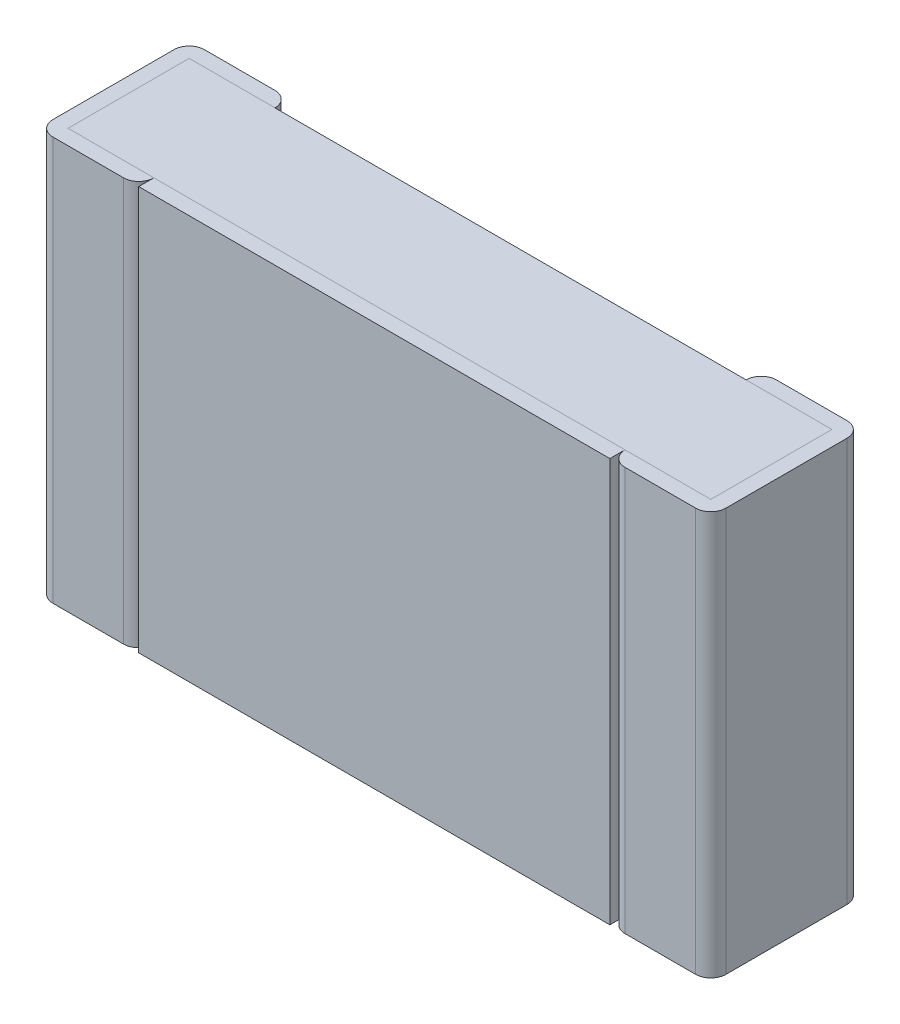
ISO-10303-21;
HEADER;
FILE_DESCRIPTION(('STEP AP214'),'2;1');
FILE_NAME('part.step','',(''),(''),'','','');
FILE_SCHEMA(('AUTOMOTIVE_DESIGN { 1 0 10303 214 1 1 1 1 }'));
ENDSEC;
DATA;
#1=APPLICATION_CONTEXT('core data for automotive mechanical design processes');
#2=APPLICATION_PROTOCOL_DEFINITION('international standard','automotive_design',2000,#1);
#3=PRODUCT_CONTEXT('',#1,'mechanical');
#4=PRODUCT('Part','Part','',(#3));
#5=PRODUCT_RELATED_PRODUCT_CATEGORY('part','',(#4));
#6=PRODUCT_DEFINITION_FORMATION('','',#4);
#7=PRODUCT_DEFINITION_CONTEXT('part definition',#1,'design');
#8=PRODUCT_DEFINITION('design','',#6,#7);
#9=PRODUCT_DEFINITION_SHAPE('','',#8);
#10=(LENGTH_UNIT() NAMED_UNIT(*) SI_UNIT(.MILLI.,.METRE.));
#11=(NAMED_UNIT(*) PLANE_ANGLE_UNIT() SI_UNIT($,.RADIAN.));
#12=(NAMED_UNIT(*) SI_UNIT($,.STERADIAN.) SOLID_ANGLE_UNIT());
#13=UNCERTAINTY_MEASURE_WITH_UNIT(LENGTH_MEASURE(1.E-05),#10,'distance_accuracy_value','');
#14=(GEOMETRIC_REPRESENTATION_CONTEXT(3) GLOBAL_UNCERTAINTY_ASSIGNED_CONTEXT((#13)) GLOBAL_UNIT_ASSIGNED_CONTEXT((#10,
#11,#12)) REPRESENTATION_CONTEXT('',''));
#15=CARTESIAN_POINT('',(0.,0.,0.));
#16=DIRECTION('',(0.,0.,1.));
#17=DIRECTION('',(1.,0.,0.));
#18=AXIS2_PLACEMENT_3D('',#15,#16,#17);
#19=CARTESIAN_POINT('',(-1.,-0.6,0.));
#20=DIRECTION('',(1.,0.,0.));
#21=DIRECTION('',(0.,1.,0.));
#22=AXIS2_PLACEMENT_3D('',#19,#20,#21);
#23=PLANE('',#22);
#24=DIRECTION('',(0.,1.,0.));
#25=VECTOR('',#24,1.);
#26=CARTESIAN_POINT('',(-1.,-0.6,0.405));
#27=LINE('',#26,#25);
#28=CARTESIAN_POINT('',(-1.,-0.6,0.405));
#29=VERTEX_POINT('',#28);
#30=CARTESIAN_POINT('',(-1.,0.6,0.405));
#31=VERTEX_POINT('',#30);
#32=EDGE_CURVE('E11',#29,#31,#27,.T.);
#33=ORIENTED_EDGE('',*,*,#32,.T.);
#34=DIRECTION('',(0.,0.,1.));
#35=VECTOR('',#34,1.);
#36=CARTESIAN_POINT('',(-1.,0.6,0.));
#37=LINE('',#36,#35);
#38=CARTESIAN_POINT('',(-1.,0.6,0.045));
#39=VERTEX_POINT('',#38);
#40=EDGE_CURVE('E41',#39,#31,#37,.T.);
#41=ORIENTED_EDGE('',*,*,#40,.F.);
#42=DIRECTION('',(0.,1.,0.));
#43=VECTOR('',#42,1.);
#44=CARTESIAN_POINT('',(-1.,-0.6,0.045));
#45=LINE('',#44,#43);
#46=CARTESIAN_POINT('',(-1.,-0.6,0.045));
#47=VERTEX_POINT('',#46);
#48=EDGE_CURVE('E222',#47,#39,#45,.T.);
#49=ORIENTED_EDGE('',*,*,#48,.F.);
#50=DIRECTION('',(0.,0.,1.));
#51=VECTOR('',#50,1.);
#52=CARTESIAN_POINT('',(-1.,-0.6,0.));
#53=LINE('',#52,#51);
#54=EDGE_CURVE('E27',#47,#29,#53,.T.);
#55=ORIENTED_EDGE('',*,*,#54,.T.);
#56=EDGE_LOOP('',(#33,#41,#49,#55));
#57=FACE_BOUND('',#56,.T.);
#58=ADVANCED_FACE('F16',(#57),#23,.F.);
#59=CARTESIAN_POINT('',(-1.,-0.6,0.));
#60=DIRECTION('',(0.,1.,0.));
#61=DIRECTION('',(1.,0.,0.));
#62=AXIS2_PLACEMENT_3D('',#59,#60,#61);
#63=PLANE('',#62);
#64=CARTESIAN_POINT('',(-0.745,-0.6,0.045));
#65=DIRECTION('',(0.,1.,0.));
#66=DIRECTION('',(0.,0.,1.));
#67=AXIS2_PLACEMENT_3D('',#64,#65,#66);
#68=CIRCLE('',#67,0.045);
#69=CARTESIAN_POINT('',(-0.7,-0.6,0.045));
#70=VERTEX_POINT('',#69);
#71=CARTESIAN_POINT('',(-0.745,-0.6,0.));
#72=VERTEX_POINT('',#71);
#73=EDGE_CURVE('E248',#70,#72,#68,.T.);
#74=ORIENTED_EDGE('',*,*,#73,.F.);
#75=DIRECTION('',(1.,0.,0.));
#76=VECTOR('',#75,1.);
#77=CARTESIAN_POINT('',(-0.955,-0.6,0.045));
#78=LINE('',#77,#76);
#79=CARTESIAN_POINT('',(-0.955,-0.6,0.045));
#80=VERTEX_POINT('',#79);
#81=EDGE_CURVE('E274',#80,#70,#78,.T.);
#82=ORIENTED_EDGE('',*,*,#81,.F.);
#83=DIRECTION('',(0.,0.,1.));
#84=VECTOR('',#83,1.);
#85=CARTESIAN_POINT('',(-0.955,-0.6,0.045));
#86=LINE('',#85,#84);
#87=CARTESIAN_POINT('',(-0.955,-0.6,0.405));
#88=VERTEX_POINT('',#87);
#89=EDGE_CURVE('E257',#80,#88,#86,.T.);
#90=ORIENTED_EDGE('',*,*,#89,.T.);
#91=DIRECTION('',(1.,0.,0.));
#92=VECTOR('',#91,1.);
#93=CARTESIAN_POINT('',(-0.955,-0.6,0.405));
#94=LINE('',#93,#92);
#95=CARTESIAN_POINT('',(-0.7,-0.6,0.405));
#96=VERTEX_POINT('',#95);
#97=EDGE_CURVE('E356',#88,#96,#94,.T.);
#98=ORIENTED_EDGE('',*,*,#97,.T.);
#99=CARTESIAN_POINT('',(-0.745,-0.6,0.405));
#100=DIRECTION('',(0.,-1.,0.));
#101=DIRECTION('',(0.,0.,1.));
#102=AXIS2_PLACEMENT_3D('',#99,#100,#101);
#103=CIRCLE('',#102,0.045);
#104=CARTESIAN_POINT('',(-0.745,-0.6,0.45));
#105=VERTEX_POINT('',#104);
#106=EDGE_CURVE('E231',#96,#105,#103,.T.);
#107=ORIENTED_EDGE('',*,*,#106,.T.);
#108=DIRECTION('',(1.,0.,0.));
#109=VECTOR('',#108,1.);
#110=CARTESIAN_POINT('',(-1.,-0.6,0.45));
#111=LINE('',#110,#109);
#112=CARTESIAN_POINT('',(-0.955,-0.6,0.45));
#113=VERTEX_POINT('',#112);
#114=EDGE_CURVE('E381',#113,#105,#111,.T.);
#115=ORIENTED_EDGE('',*,*,#114,.F.);
#116=CARTESIAN_POINT('',(-0.955,-0.6,0.405));
#117=DIRECTION('',(0.,1.,0.));
#118=DIRECTION('',(0.,0.,1.));
#119=AXIS2_PLACEMENT_3D('',#116,#117,#118);
#120=CIRCLE('',#119,0.045);
#121=EDGE_CURVE('E406',#29,#113,#120,.T.);
#122=ORIENTED_EDGE('',*,*,#121,.F.);
#123=ORIENTED_EDGE('',*,*,#54,.F.);
#124=CARTESIAN_POINT('',(-0.955,-0.6,0.045));
#125=DIRECTION('',(0.,-1.,0.));
#126=DIRECTION('',(0.,0.,1.));
#127=AXIS2_PLACEMENT_3D('',#124,#125,#126);
#128=CIRCLE('',#127,0.045);
#129=CARTESIAN_POINT('',(-0.955,-0.6,0.));
#130=VERTEX_POINT('',#129);
#131=EDGE_CURVE('E221',#47,#130,#128,.T.);
#132=ORIENTED_EDGE('',*,*,#131,.T.);
#133=DIRECTION('',(1.,0.,0.));
#134=VECTOR('',#133,1.);
#135=CARTESIAN_POINT('',(-1.,-0.6,0.));
#136=LINE('',#135,#134);
#137=EDGE_CURVE('E210',#130,#72,#136,.T.);
#138=ORIENTED_EDGE('',*,*,#137,.T.);
#139=EDGE_LOOP('',(#74,#82,#90,#98,#107,#115,#122,#123,#132,#138));
#140=FACE_BOUND('',#139,.T.);
#141=ADVANCED_FACE('F226',(#140),#63,.F.);
#142=CARTESIAN_POINT('',(-0.955,-0.6,0.045));
#143=DIRECTION('',(0.,1.,0.));
#144=DIRECTION('',(-1.,0.,0.));
#145=AXIS2_PLACEMENT_3D('',#142,#143,#144);
#146=CYLINDRICAL_SURFACE('',#145,0.045);
#147=ORIENTED_EDGE('',*,*,#48,.T.);
#148=CARTESIAN_POINT('',(-0.955,0.6,0.045));
#149=DIRECTION('',(0.,-1.,0.));
#150=DIRECTION('',(0.,0.,1.));
#151=AXIS2_PLACEMENT_3D('',#148,#149,#150);
#152=CIRCLE('',#151,0.045);
#153=CARTESIAN_POINT('',(-0.955,0.6,0.));
#154=VERTEX_POINT('',#153);
#155=EDGE_CURVE('E234',#39,#154,#152,.T.);
#156=ORIENTED_EDGE('',*,*,#155,.T.);
#157=DIRECTION('',(0.,1.,0.));
#158=VECTOR('',#157,1.);
#159=CARTESIAN_POINT('',(-0.955,-0.6,0.));
#160=LINE('',#159,#158);
#161=EDGE_CURVE('E214',#130,#154,#160,.T.);
#162=ORIENTED_EDGE('',*,*,#161,.F.);
#163=ORIENTED_EDGE('',*,*,#131,.F.);
#164=EDGE_LOOP('',(#147,#156,#162,#163));
#165=FACE_BOUND('',#164,.T.);
#166=ADVANCED_FACE('F233',(#165),#146,.T.);
#167=CARTESIAN_POINT('',(-0.955,-0.6,0.405));
#168=DIRECTION('',(0.,1.,0.));
#169=DIRECTION('',(-1.,0.,0.));
#170=AXIS2_PLACEMENT_3D('',#167,#168,#169);
#171=CYLINDRICAL_SURFACE('',#170,0.045);
#172=ORIENTED_EDGE('',*,*,#121,.T.);
#173=DIRECTION('',(0.,1.,0.));
#174=VECTOR('',#173,1.);
#175=CARTESIAN_POINT('',(-0.955,-0.6,0.45));
#176=LINE('',#175,#174);
#177=CARTESIAN_POINT('',(-0.955,0.6,0.45));
#178=VERTEX_POINT('',#177);
#179=EDGE_CURVE('E410',#113,#178,#176,.T.);
#180=ORIENTED_EDGE('',*,*,#179,.T.);
#181=CARTESIAN_POINT('',(-0.955,0.6,0.405));
#182=DIRECTION('',(0.,1.,0.));
#183=DIRECTION('',(0.,0.,1.));
#184=AXIS2_PLACEMENT_3D('',#181,#182,#183);
#185=CIRCLE('',#184,0.045);
#186=EDGE_CURVE('E374',#31,#178,#185,.T.);
#187=ORIENTED_EDGE('',*,*,#186,.F.);
#188=ORIENTED_EDGE('',*,*,#32,.F.);
#189=EDGE_LOOP('',(#172,#180,#187,#188));
#190=FACE_BOUND('',#189,.T.);
#191=ADVANCED_FACE('F584',(#190),#171,.T.);
#192=CARTESIAN_POINT('',(-1.,0.6,0.));
#193=DIRECTION('',(0.,1.,0.));
#194=DIRECTION('',(1.,0.,0.));
#195=AXIS2_PLACEMENT_3D('',#192,#193,#194);
#196=PLANE('',#195);
#197=DIRECTION('',(1.,0.,0.));
#198=VECTOR('',#197,1.);
#199=CARTESIAN_POINT('',(-1.,0.6,0.));
#200=LINE('',#199,#198);
#201=CARTESIAN_POINT('',(-0.745,0.6,0.));
#202=VERTEX_POINT('',#201);
#203=EDGE_CURVE('E238',#154,#202,#200,.T.);
#204=ORIENTED_EDGE('',*,*,#203,.F.);
#205=ORIENTED_EDGE('',*,*,#155,.F.);
#206=ORIENTED_EDGE('',*,*,#40,.T.);
#207=ORIENTED_EDGE('',*,*,#186,.T.);
#208=DIRECTION('',(1.,0.,0.));
#209=VECTOR('',#208,1.);
#210=CARTESIAN_POINT('',(-1.,0.6,0.45));
#211=LINE('',#210,#209);
#212=CARTESIAN_POINT('',(-0.745,0.6,0.45));
#213=VERTEX_POINT('',#212);
#214=EDGE_CURVE('E371',#178,#213,#211,.T.);
#215=ORIENTED_EDGE('',*,*,#214,.T.);
#216=CARTESIAN_POINT('',(-0.745,0.6,0.405));
#217=DIRECTION('',(0.,-1.,0.));
#218=DIRECTION('',(0.,0.,1.));
#219=AXIS2_PLACEMENT_3D('',#216,#217,#218);
#220=CIRCLE('',#219,0.045);
#221=CARTESIAN_POINT('',(-0.7,0.6,0.405));
#222=VERTEX_POINT('',#221);
#223=EDGE_CURVE('E263',#222,#213,#220,.T.);
#224=ORIENTED_EDGE('',*,*,#223,.F.);
#225=DIRECTION('',(1.,0.,0.));
#226=VECTOR('',#225,1.);
#227=CARTESIAN_POINT('',(-0.955,0.6,0.405));
#228=LINE('',#227,#226);
#229=CARTESIAN_POINT('',(-0.955,0.6,0.405));
#230=VERTEX_POINT('',#229);
#231=EDGE_CURVE('E352',#230,#222,#228,.T.);
#232=ORIENTED_EDGE('',*,*,#231,.F.);
#233=DIRECTION('',(0.,0.,1.));
#234=VECTOR('',#233,1.);
#235=CARTESIAN_POINT('',(-0.955,0.6,0.045));
#236=LINE('',#235,#234);
#237=CARTESIAN_POINT('',(-0.955,0.6,0.045));
#238=VERTEX_POINT('',#237);
#239=EDGE_CURVE('E348',#238,#230,#236,.T.);
#240=ORIENTED_EDGE('',*,*,#239,.F.);
#241=DIRECTION('',(1.,0.,0.));
#242=VECTOR('',#241,1.);
#243=CARTESIAN_POINT('',(-0.955,0.6,0.045));
#244=LINE('',#243,#242);
#245=CARTESIAN_POINT('',(-0.7,0.6,0.045));
#246=VERTEX_POINT('',#245);
#247=EDGE_CURVE('E245',#238,#246,#244,.T.);
#248=ORIENTED_EDGE('',*,*,#247,.T.);
#249=CARTESIAN_POINT('',(-0.745,0.6,0.045));
#250=DIRECTION('',(0.,1.,0.));
#251=DIRECTION('',(0.,0.,1.));
#252=AXIS2_PLACEMENT_3D('',#249,#250,#251);
#253=CIRCLE('',#252,0.045);
#254=EDGE_CURVE('E237',#246,#202,#253,.T.);
#255=ORIENTED_EDGE('',*,*,#254,.T.);
#256=EDGE_LOOP('',(#204,#205,#206,#207,#215,#224,#232,#240,#248,#255));
#257=FACE_BOUND('',#256,.T.);
#258=ADVANCED_FACE('F372',(#257),#196,.T.);
#259=CARTESIAN_POINT('',(-1.,-0.6,0.));
#260=DIRECTION('',(0.,0.,1.));
#261=DIRECTION('',(1.,0.,0.));
#262=AXIS2_PLACEMENT_3D('',#259,#260,#261);
#263=PLANE('',#262);
#264=DIRECTION('',(0.,1.,0.));
#265=VECTOR('',#264,1.);
#266=CARTESIAN_POINT('',(-0.745,-0.6,0.));
#267=LINE('',#266,#265);
#268=EDGE_CURVE('E217',#72,#202,#267,.T.);
#269=ORIENTED_EDGE('',*,*,#268,.F.);
#270=ORIENTED_EDGE('',*,*,#137,.F.);
#271=ORIENTED_EDGE('',*,*,#161,.T.);
#272=ORIENTED_EDGE('',*,*,#203,.T.);
#273=EDGE_LOOP('',(#269,#270,#271,#272));
#274=FACE_BOUND('',#273,.T.);
#275=ADVANCED_FACE('F212',(#274),#263,.F.);
#276=CARTESIAN_POINT('',(-0.745,-0.6,0.045));
#277=DIRECTION('',(0.,1.,0.));
#278=DIRECTION('',(1.,0.,0.));
#279=AXIS2_PLACEMENT_3D('',#276,#277,#278);
#280=CYLINDRICAL_SURFACE('',#279,0.045);
#281=ORIENTED_EDGE('',*,*,#73,.T.);
#282=ORIENTED_EDGE('',*,*,#268,.T.);
#283=ORIENTED_EDGE('',*,*,#254,.F.);
#284=DIRECTION('',(0.,1.,0.));
#285=VECTOR('',#284,1.);
#286=CARTESIAN_POINT('',(-0.7,-0.6,0.045));
#287=LINE('',#286,#285);
#288=EDGE_CURVE('E291',#70,#246,#287,.T.);
#289=ORIENTED_EDGE('',*,*,#288,.F.);
#290=EDGE_LOOP('',(#281,#282,#283,#289));
#291=FACE_BOUND('',#290,.T.);
#292=ADVANCED_FACE('F585',(#291),#280,.T.);
#293=CARTESIAN_POINT('',(-0.955,-0.6,0.045));
#294=DIRECTION('',(0.,1.,0.));
#295=DIRECTION('',(1.,0.,0.));
#296=AXIS2_PLACEMENT_3D('',#293,#294,#295);
#297=PLANE('',#296);
#298=DIRECTION('',(1.,0.,0.));
#299=VECTOR('',#298,1.);
#300=CARTESIAN_POINT('',(-0.955,-0.6,0.045));
#301=LINE('',#300,#299);
#302=CARTESIAN_POINT('',(0.7,-0.6,0.045));
#303=VERTEX_POINT('',#302);
#304=EDGE_CURVE('E323',#70,#303,#301,.T.);
#305=ORIENTED_EDGE('',*,*,#304,.T.);
#306=DIRECTION('',(1.,0.,0.));
#307=VECTOR('',#306,1.);
#308=CARTESIAN_POINT('',(-0.955,-0.6,0.045));
#309=LINE('',#308,#307);
#310=CARTESIAN_POINT('',(0.955,-0.6,0.045));
#311=VERTEX_POINT('',#310);
#312=EDGE_CURVE('E273',#303,#311,#309,.T.);
#313=ORIENTED_EDGE('',*,*,#312,.T.);
#314=DIRECTION('',(0.,0.,1.));
#315=VECTOR('',#314,1.);
#316=CARTESIAN_POINT('',(0.955,-0.6,0.045));
#317=LINE('',#316,#315);
#318=CARTESIAN_POINT('',(0.955,-0.6,0.405));
#319=VERTEX_POINT('',#318);
#320=EDGE_CURVE('E270',#311,#319,#317,.T.);
#321=ORIENTED_EDGE('',*,*,#320,.T.);
#322=DIRECTION('',(1.,0.,0.));
#323=VECTOR('',#322,1.);
#324=CARTESIAN_POINT('',(-0.955,-0.6,0.405));
#325=LINE('',#324,#323);
#326=CARTESIAN_POINT('',(0.7,-0.6,0.405));
#327=VERTEX_POINT('',#326);
#328=EDGE_CURVE('E264',#327,#319,#325,.T.);
#329=ORIENTED_EDGE('',*,*,#328,.F.);
#330=DIRECTION('',(1.,0.,0.));
#331=VECTOR('',#330,1.);
#332=CARTESIAN_POINT('',(-0.7,-0.6,0.405));
#333=LINE('',#332,#331);
#334=EDGE_CURVE('E295',#96,#327,#333,.T.);
#335=ORIENTED_EDGE('',*,*,#334,.F.);
#336=ORIENTED_EDGE('',*,*,#97,.F.);
#337=ORIENTED_EDGE('',*,*,#89,.F.);
#338=ORIENTED_EDGE('',*,*,#81,.T.);
#339=EDGE_LOOP('',(#305,#313,#321,#329,#335,#336,#337,#338));
#340=FACE_BOUND('',#339,.T.);
#341=ADVANCED_FACE('F506',(#340),#297,.F.);
#342=CARTESIAN_POINT('',(-1.,-0.6,0.45));
#343=DIRECTION('',(0.,0.,1.));
#344=DIRECTION('',(1.,0.,0.));
#345=AXIS2_PLACEMENT_3D('',#342,#343,#344);
#346=PLANE('',#345);
#347=ORIENTED_EDGE('',*,*,#214,.F.);
#348=ORIENTED_EDGE('',*,*,#179,.F.);
#349=ORIENTED_EDGE('',*,*,#114,.T.);
#350=DIRECTION('',(0.,1.,0.));
#351=VECTOR('',#350,1.);
#352=CARTESIAN_POINT('',(-0.745,-0.6,0.45));
#353=LINE('',#352,#351);
#354=EDGE_CURVE('E262',#105,#213,#353,.T.);
#355=ORIENTED_EDGE('',*,*,#354,.T.);
#356=EDGE_LOOP('',(#347,#348,#349,#355));
#357=FACE_BOUND('',#356,.T.);
#358=ADVANCED_FACE('F380',(#357),#346,.T.);
#359=CARTESIAN_POINT('',(-0.745,-0.6,0.405));
#360=DIRECTION('',(0.,1.,0.));
#361=DIRECTION('',(1.,0.,0.));
#362=AXIS2_PLACEMENT_3D('',#359,#360,#361);
#363=CYLINDRICAL_SURFACE('',#362,0.045);
#364=DIRECTION('',(0.,1.,0.));
#365=VECTOR('',#364,1.);
#366=CARTESIAN_POINT('',(-0.7,-0.6,0.405));
#367=LINE('',#366,#365);
#368=EDGE_CURVE('E258',#96,#222,#367,.T.);
#369=ORIENTED_EDGE('',*,*,#368,.T.);
#370=ORIENTED_EDGE('',*,*,#223,.T.);
#371=ORIENTED_EDGE('',*,*,#354,.F.);
#372=ORIENTED_EDGE('',*,*,#106,.F.);
#373=EDGE_LOOP('',(#369,#370,#371,#372));
#374=FACE_BOUND('',#373,.T.);
#375=ADVANCED_FACE('F366',(#374),#363,.T.);
#376=CARTESIAN_POINT('',(-0.955,0.6,0.045));
#377=DIRECTION('',(0.,1.,0.));
#378=DIRECTION('',(1.,0.,0.));
#379=AXIS2_PLACEMENT_3D('',#376,#377,#378);
#380=PLANE('',#379);
#381=ORIENTED_EDGE('',*,*,#247,.F.);
#382=ORIENTED_EDGE('',*,*,#239,.T.);
#383=ORIENTED_EDGE('',*,*,#231,.T.);
#384=DIRECTION('',(1.,0.,0.));
#385=VECTOR('',#384,1.);
#386=CARTESIAN_POINT('',(-0.7,0.6,0.405));
#387=LINE('',#386,#385);
#388=CARTESIAN_POINT('',(0.7,0.6,0.405));
#389=VERTEX_POINT('',#388);
#390=EDGE_CURVE('E414',#222,#389,#387,.T.);
#391=ORIENTED_EDGE('',*,*,#390,.T.);
#392=DIRECTION('',(1.,0.,0.));
#393=VECTOR('',#392,1.);
#394=CARTESIAN_POINT('',(-0.955,0.6,0.405));
#395=LINE('',#394,#393);
#396=CARTESIAN_POINT('',(0.955,0.6,0.405));
#397=VERTEX_POINT('',#396);
#398=EDGE_CURVE('E411',#389,#397,#395,.T.);
#399=ORIENTED_EDGE('',*,*,#398,.T.);
#400=DIRECTION('',(0.,0.,1.));
#401=VECTOR('',#400,1.);
#402=CARTESIAN_POINT('',(0.955,0.6,0.045));
#403=LINE('',#402,#401);
#404=CARTESIAN_POINT('',(0.955,0.6,0.045));
#405=VERTEX_POINT('',#404);
#406=EDGE_CURVE('E334',#405,#397,#403,.T.);
#407=ORIENTED_EDGE('',*,*,#406,.F.);
#408=DIRECTION('',(1.,0.,0.));
#409=VECTOR('',#408,1.);
#410=CARTESIAN_POINT('',(-0.955,0.6,0.045));
#411=LINE('',#410,#409);
#412=CARTESIAN_POINT('',(0.7,0.6,0.045));
#413=VERTEX_POINT('',#412);
#414=EDGE_CURVE('E317',#413,#405,#411,.T.);
#415=ORIENTED_EDGE('',*,*,#414,.F.);
#416=DIRECTION('',(1.,0.,0.));
#417=VECTOR('',#416,1.);
#418=CARTESIAN_POINT('',(-0.955,0.6,0.045));
#419=LINE('',#418,#417);
#420=EDGE_CURVE('E293',#246,#413,#419,.T.);
#421=ORIENTED_EDGE('',*,*,#420,.F.);
#422=EDGE_LOOP('',(#381,#382,#383,#391,#399,#407,#415,#421));
#423=FACE_BOUND('',#422,.T.);
#424=ADVANCED_FACE('F514',(#423),#380,.T.);
#425=CARTESIAN_POINT('',(-0.955,-0.6,0.045));
#426=DIRECTION('',(0.,0.,1.));
#427=DIRECTION('',(1.,0.,0.));
#428=AXIS2_PLACEMENT_3D('',#425,#426,#427);
#429=PLANE('',#428);
#430=ORIENTED_EDGE('',*,*,#420,.T.);
#431=DIRECTION('',(0.,1.,0.));
#432=VECTOR('',#431,1.);
#433=CARTESIAN_POINT('',(0.7,-0.6,0.045));
#434=LINE('',#433,#432);
#435=EDGE_CURVE('E280',#303,#413,#434,.T.);
#436=ORIENTED_EDGE('',*,*,#435,.F.);
#437=ORIENTED_EDGE('',*,*,#304,.F.);
#438=ORIENTED_EDGE('',*,*,#288,.T.);
#439=EDGE_LOOP('',(#430,#436,#437,#438));
#440=FACE_BOUND('',#439,.T.);
#441=ADVANCED_FACE('F509',(#440),#429,.F.);
#442=CARTESIAN_POINT('',(0.7,-0.6,0.));
#443=DIRECTION('',(0.,1.,0.));
#444=DIRECTION('',(1.,0.,0.));
#445=AXIS2_PLACEMENT_3D('',#442,#443,#444);
#446=PLANE('',#445);
#447=CARTESIAN_POINT('',(0.955,-0.6,0.045));
#448=DIRECTION('',(0.,1.,0.));
#449=DIRECTION('',(0.,0.,1.));
#450=AXIS2_PLACEMENT_3D('',#447,#448,#449);
#451=CIRCLE('',#450,0.045);
#452=CARTESIAN_POINT('',(1.,-0.6,0.045));
#453=VERTEX_POINT('',#452);
#454=CARTESIAN_POINT('',(0.955,-0.6,0.));
#455=VERTEX_POINT('',#454);
#456=EDGE_CURVE('E339',#453,#455,#451,.T.);
#457=ORIENTED_EDGE('',*,*,#456,.F.);
#458=DIRECTION('',(0.,0.,1.));
#459=VECTOR('',#458,1.);
#460=CARTESIAN_POINT('',(1.,-0.6,0.));
#461=LINE('',#460,#459);
#462=CARTESIAN_POINT('',(1.,-0.6,0.405));
#463=VERTEX_POINT('',#462);
#464=EDGE_CURVE('E294',#453,#463,#461,.T.);
#465=ORIENTED_EDGE('',*,*,#464,.T.);
#466=CARTESIAN_POINT('',(0.955,-0.6,0.405));
#467=DIRECTION('',(0.,-1.,0.));
#468=DIRECTION('',(0.,0.,1.));
#469=AXIS2_PLACEMENT_3D('',#466,#467,#468);
#470=CIRCLE('',#469,0.045);
#471=CARTESIAN_POINT('',(0.955,-0.6,0.45));
#472=VERTEX_POINT('',#471);
#473=EDGE_CURVE('E268',#463,#472,#470,.T.);
#474=ORIENTED_EDGE('',*,*,#473,.T.);
#475=DIRECTION('',(1.,0.,0.));
#476=VECTOR('',#475,1.);
#477=CARTESIAN_POINT('',(0.7,-0.6,0.45));
#478=LINE('',#477,#476);
#479=CARTESIAN_POINT('',(0.745,-0.6,0.45));
#480=VERTEX_POINT('',#479);
#481=EDGE_CURVE('E344',#480,#472,#478,.T.);
#482=ORIENTED_EDGE('',*,*,#481,.F.);
#483=CARTESIAN_POINT('',(0.745,-0.6,0.405));
#484=DIRECTION('',(0.,1.,0.));
#485=DIRECTION('',(0.,0.,1.));
#486=AXIS2_PLACEMENT_3D('',#483,#484,#485);
#487=CIRCLE('',#486,0.045);
#488=EDGE_CURVE('E357',#327,#480,#487,.T.);
#489=ORIENTED_EDGE('',*,*,#488,.F.);
#490=ORIENTED_EDGE('',*,*,#328,.T.);
#491=ORIENTED_EDGE('',*,*,#320,.F.);
#492=ORIENTED_EDGE('',*,*,#312,.F.);
#493=CARTESIAN_POINT('',(0.745,-0.6,0.045));
#494=DIRECTION('',(0.,-1.,0.));
#495=DIRECTION('',(0.,0.,1.));
#496=AXIS2_PLACEMENT_3D('',#493,#494,#495);
#497=CIRCLE('',#496,0.045);
#498=CARTESIAN_POINT('',(0.745,-0.6,0.));
#499=VERTEX_POINT('',#498);
#500=EDGE_CURVE('E269',#303,#499,#497,.T.);
#501=ORIENTED_EDGE('',*,*,#500,.T.);
#502=DIRECTION('',(1.,0.,0.));
#503=VECTOR('',#502,1.);
#504=CARTESIAN_POINT('',(0.7,-0.6,0.));
#505=LINE('',#504,#503);
#506=EDGE_CURVE('E290',#499,#455,#505,.T.);
#507=ORIENTED_EDGE('',*,*,#506,.T.);
#508=EDGE_LOOP('',(#457,#465,#474,#482,#489,#490,#491,#492,#501,#507));
#509=FACE_BOUND('',#508,.T.);
#510=ADVANCED_FACE('F501',(#509),#446,.F.);
#511=CARTESIAN_POINT('',(-0.7,-0.6,0.405));
#512=DIRECTION('',(0.,1.,0.));
#513=DIRECTION('',(1.,0.,0.));
#514=AXIS2_PLACEMENT_3D('',#511,#512,#513);
#515=PLANE('',#514);
#516=DIRECTION('',(0.,0.,1.));
#517=VECTOR('',#516,1.);
#518=CARTESIAN_POINT('',(0.7,-0.6,0.405));
#519=LINE('',#518,#517);
#520=CARTESIAN_POINT('',(0.7,-0.6,0.45));
#521=VERTEX_POINT('',#520);
#522=EDGE_CURVE('E252',#327,#521,#519,.T.);
#523=ORIENTED_EDGE('',*,*,#522,.T.);
#524=DIRECTION('',(1.,0.,0.));
#525=VECTOR('',#524,1.);
#526=CARTESIAN_POINT('',(-0.7,-0.6,0.45));
#527=LINE('',#526,#525);
#528=CARTESIAN_POINT('',(-0.7,-0.6,0.45));
#529=VERTEX_POINT('',#528);
#530=EDGE_CURVE('E405',#529,#521,#527,.T.);
#531=ORIENTED_EDGE('',*,*,#530,.F.);
#532=DIRECTION('',(0.,0.,1.));
#533=VECTOR('',#532,1.);
#534=CARTESIAN_POINT('',(-0.7,-0.6,0.405));
#535=LINE('',#534,#533);
#536=EDGE_CURVE('E307',#96,#529,#535,.T.);
#537=ORIENTED_EDGE('',*,*,#536,.F.);
#538=ORIENTED_EDGE('',*,*,#334,.T.);
#539=EDGE_LOOP('',(#523,#531,#537,#538));
#540=FACE_BOUND('',#539,.T.);
#541=ADVANCED_FACE('F541',(#540),#515,.F.);
#542=CARTESIAN_POINT('',(-0.7,-0.6,0.405));
#543=DIRECTION('',(1.,0.,0.));
#544=DIRECTION('',(0.,1.,0.));
#545=AXIS2_PLACEMENT_3D('',#542,#543,#544);
#546=PLANE('',#545);
#547=DIRECTION('',(0.,1.,0.));
#548=VECTOR('',#547,1.);
#549=CARTESIAN_POINT('',(-0.7,-0.6,0.45));
#550=LINE('',#549,#548);
#551=CARTESIAN_POINT('',(-0.7,0.6,0.45));
#552=VERTEX_POINT('',#551);
#553=EDGE_CURVE('E298',#529,#552,#550,.T.);
#554=ORIENTED_EDGE('',*,*,#553,.T.);
#555=DIRECTION('',(0.,0.,1.));
#556=VECTOR('',#555,1.);
#557=CARTESIAN_POINT('',(-0.7,0.6,0.405));
#558=LINE('',#557,#556);
#559=EDGE_CURVE('E279',#222,#552,#558,.T.);
#560=ORIENTED_EDGE('',*,*,#559,.F.);
#561=ORIENTED_EDGE('',*,*,#368,.F.);
#562=ORIENTED_EDGE('',*,*,#536,.T.);
#563=EDGE_LOOP('',(#554,#560,#561,#562));
#564=FACE_BOUND('',#563,.T.);
#565=ADVANCED_FACE('F540',(#564),#546,.F.);
#566=CARTESIAN_POINT('',(0.7,0.6,0.));
#567=DIRECTION('',(0.,1.,0.));
#568=DIRECTION('',(1.,0.,0.));
#569=AXIS2_PLACEMENT_3D('',#566,#567,#568);
#570=PLANE('',#569);
#571=DIRECTION('',(1.,0.,0.));
#572=VECTOR('',#571,1.);
#573=CARTESIAN_POINT('',(0.7,0.6,0.));
#574=LINE('',#573,#572);
#575=CARTESIAN_POINT('',(0.745,0.6,0.));
#576=VERTEX_POINT('',#575);
#577=CARTESIAN_POINT('',(0.955,0.6,0.));
#578=VERTEX_POINT('',#577);
#579=EDGE_CURVE('E341',#576,#578,#574,.T.);
#580=ORIENTED_EDGE('',*,*,#579,.F.);
#581=CARTESIAN_POINT('',(0.745,0.6,0.045));
#582=DIRECTION('',(0.,-1.,0.));
#583=DIRECTION('',(0.,0.,1.));
#584=AXIS2_PLACEMENT_3D('',#581,#582,#583);
#585=CIRCLE('',#584,0.045);
#586=EDGE_CURVE('E429',#413,#576,#585,.T.);
#587=ORIENTED_EDGE('',*,*,#586,.F.);
#588=ORIENTED_EDGE('',*,*,#414,.T.);
#589=ORIENTED_EDGE('',*,*,#406,.T.);
#590=ORIENTED_EDGE('',*,*,#398,.F.);
#591=CARTESIAN_POINT('',(0.745,0.6,0.405));
#592=DIRECTION('',(0.,1.,0.));
#593=DIRECTION('',(0.,0.,1.));
#594=AXIS2_PLACEMENT_3D('',#591,#592,#593);
#595=CIRCLE('',#594,0.045);
#596=CARTESIAN_POINT('',(0.745,0.6,0.45));
#597=VERTEX_POINT('',#596);
#598=EDGE_CURVE('E330',#389,#597,#595,.T.);
#599=ORIENTED_EDGE('',*,*,#598,.T.);
#600=DIRECTION('',(1.,0.,0.));
#601=VECTOR('',#600,1.);
#602=CARTESIAN_POINT('',(0.7,0.6,0.45));
#603=LINE('',#602,#601);
#604=CARTESIAN_POINT('',(0.955,0.6,0.45));
#605=VERTEX_POINT('',#604);
#606=EDGE_CURVE('E335',#597,#605,#603,.T.);
#607=ORIENTED_EDGE('',*,*,#606,.T.);
#608=CARTESIAN_POINT('',(0.955,0.6,0.405));
#609=DIRECTION('',(0.,-1.,0.));
#610=DIRECTION('',(0.,0.,1.));
#611=AXIS2_PLACEMENT_3D('',#608,#609,#610);
#612=CIRCLE('',#611,0.045);
#613=CARTESIAN_POINT('',(1.,0.6,0.405));
#614=VERTEX_POINT('',#613);
#615=EDGE_CURVE('E286',#614,#605,#612,.T.);
#616=ORIENTED_EDGE('',*,*,#615,.F.);
#617=DIRECTION('',(0.,0.,1.));
#618=VECTOR('',#617,1.);
#619=CARTESIAN_POINT('',(1.,0.6,0.));
#620=LINE('',#619,#618);
#621=CARTESIAN_POINT('',(1.,0.6,0.045));
#622=VERTEX_POINT('',#621);
#623=EDGE_CURVE('E285',#622,#614,#620,.T.);
#624=ORIENTED_EDGE('',*,*,#623,.F.);
#625=CARTESIAN_POINT('',(0.955,0.6,0.045));
#626=DIRECTION('',(0.,1.,0.));
#627=DIRECTION('',(0.,0.,1.));
#628=AXIS2_PLACEMENT_3D('',#625,#626,#627);
#629=CIRCLE('',#628,0.045);
#630=EDGE_CURVE('E393',#622,#578,#629,.T.);
#631=ORIENTED_EDGE('',*,*,#630,.T.);
#632=EDGE_LOOP('',(#580,#587,#588,#589,#590,#599,#607,#616,#624,#631));
#633=FACE_BOUND('',#632,.T.);
#634=ADVANCED_FACE('F494',(#633),#570,.T.);
#635=CARTESIAN_POINT('',(-0.7,0.6,0.405));
#636=DIRECTION('',(0.,1.,0.));
#637=DIRECTION('',(1.,0.,0.));
#638=AXIS2_PLACEMENT_3D('',#635,#636,#637);
#639=PLANE('',#638);
#640=ORIENTED_EDGE('',*,*,#390,.F.);
#641=ORIENTED_EDGE('',*,*,#559,.T.);
#642=DIRECTION('',(1.,0.,0.));
#643=VECTOR('',#642,1.);
#644=CARTESIAN_POINT('',(-0.7,0.6,0.45));
#645=LINE('',#644,#643);
#646=CARTESIAN_POINT('',(0.7,0.6,0.45));
#647=VERTEX_POINT('',#646);
#648=EDGE_CURVE('E275',#552,#647,#645,.T.);
#649=ORIENTED_EDGE('',*,*,#648,.T.);
#650=DIRECTION('',(0.,0.,1.));
#651=VECTOR('',#650,1.);
#652=CARTESIAN_POINT('',(0.7,0.6,0.405));
#653=LINE('',#652,#651);
#654=EDGE_CURVE('E402',#389,#647,#653,.T.);
#655=ORIENTED_EDGE('',*,*,#654,.F.);
#656=EDGE_LOOP('',(#640,#641,#649,#655));
#657=FACE_BOUND('',#656,.T.);
#658=ADVANCED_FACE('F545',(#657),#639,.T.);
#659=CARTESIAN_POINT('',(0.745,-0.6,0.045));
#660=DIRECTION('',(0.,1.,0.));
#661=DIRECTION('',(-1.,0.,0.));
#662=AXIS2_PLACEMENT_3D('',#659,#660,#661);
#663=CYLINDRICAL_SURFACE('',#662,0.045);
#664=ORIENTED_EDGE('',*,*,#435,.T.);
#665=ORIENTED_EDGE('',*,*,#586,.T.);
#666=DIRECTION('',(0.,1.,0.));
#667=VECTOR('',#666,1.);
#668=CARTESIAN_POINT('',(0.745,-0.6,0.));
#669=LINE('',#668,#667);
#670=EDGE_CURVE('E453',#499,#576,#669,.T.);
#671=ORIENTED_EDGE('',*,*,#670,.F.);
#672=ORIENTED_EDGE('',*,*,#500,.F.);
#673=EDGE_LOOP('',(#664,#665,#671,#672));
#674=FACE_BOUND('',#673,.T.);
#675=ADVANCED_FACE('F490',(#674),#663,.T.);
#676=CARTESIAN_POINT('',(0.7,-0.6,0.));
#677=DIRECTION('',(0.,0.,1.));
#678=DIRECTION('',(1.,0.,0.));
#679=AXIS2_PLACEMENT_3D('',#676,#677,#678);
#680=PLANE('',#679);
#681=DIRECTION('',(0.,1.,0.));
#682=VECTOR('',#681,1.);
#683=CARTESIAN_POINT('',(0.955,-0.6,0.));
#684=LINE('',#683,#682);
#685=EDGE_CURVE('E342',#455,#578,#684,.T.);
#686=ORIENTED_EDGE('',*,*,#685,.F.);
#687=ORIENTED_EDGE('',*,*,#506,.F.);
#688=ORIENTED_EDGE('',*,*,#670,.T.);
#689=ORIENTED_EDGE('',*,*,#579,.T.);
#690=EDGE_LOOP('',(#686,#687,#688,#689));
#691=FACE_BOUND('',#690,.T.);
#692=ADVANCED_FACE('F487',(#691),#680,.F.);
#693=CARTESIAN_POINT('',(0.955,-0.6,0.045));
#694=DIRECTION('',(0.,1.,0.));
#695=DIRECTION('',(1.,0.,0.));
#696=AXIS2_PLACEMENT_3D('',#693,#694,#695);
#697=CYLINDRICAL_SURFACE('',#696,0.045);
#698=ORIENTED_EDGE('',*,*,#456,.T.);
#699=ORIENTED_EDGE('',*,*,#685,.T.);
#700=ORIENTED_EDGE('',*,*,#630,.F.);
#701=DIRECTION('',(0.,1.,0.));
#702=VECTOR('',#701,1.);
#703=CARTESIAN_POINT('',(1.,-0.6,0.045));
#704=LINE('',#703,#702);
#705=EDGE_CURVE('E430',#453,#622,#704,.T.);
#706=ORIENTED_EDGE('',*,*,#705,.F.);
#707=EDGE_LOOP('',(#698,#699,#700,#706));
#708=FACE_BOUND('',#707,.T.);
#709=ADVANCED_FACE('F498',(#708),#697,.T.);
#710=CARTESIAN_POINT('',(1.,-0.6,0.));
#711=DIRECTION('',(1.,0.,0.));
#712=DIRECTION('',(0.,1.,0.));
#713=AXIS2_PLACEMENT_3D('',#710,#711,#712);
#714=PLANE('',#713);
#715=ORIENTED_EDGE('',*,*,#464,.F.);
#716=ORIENTED_EDGE('',*,*,#705,.T.);
#717=ORIENTED_EDGE('',*,*,#623,.T.);
#718=DIRECTION('',(0.,1.,0.));
#719=VECTOR('',#718,1.);
#720=CARTESIAN_POINT('',(1.,-0.6,0.405));
#721=LINE('',#720,#719);
#722=EDGE_CURVE('E281',#463,#614,#721,.T.);
#723=ORIENTED_EDGE('',*,*,#722,.F.);
#724=EDGE_LOOP('',(#715,#716,#717,#723));
#725=FACE_BOUND('',#724,.T.);
#726=ADVANCED_FACE('F537',(#725),#714,.T.);
#727=CARTESIAN_POINT('',(0.955,-0.6,0.405));
#728=DIRECTION('',(0.,1.,0.));
#729=DIRECTION('',(1.,0.,0.));
#730=AXIS2_PLACEMENT_3D('',#727,#728,#729);
#731=CYLINDRICAL_SURFACE('',#730,0.045);
#732=ORIENTED_EDGE('',*,*,#722,.T.);
#733=ORIENTED_EDGE('',*,*,#615,.T.);
#734=DIRECTION('',(0.,1.,0.));
#735=VECTOR('',#734,1.);
#736=CARTESIAN_POINT('',(0.955,-0.6,0.45));
#737=LINE('',#736,#735);
#738=EDGE_CURVE('E347',#472,#605,#737,.T.);
#739=ORIENTED_EDGE('',*,*,#738,.F.);
#740=ORIENTED_EDGE('',*,*,#473,.F.);
#741=EDGE_LOOP('',(#732,#733,#739,#740));
#742=FACE_BOUND('',#741,.T.);
#743=ADVANCED_FACE('F538',(#742),#731,.T.);
#744=CARTESIAN_POINT('',(0.7,-0.6,0.45));
#745=DIRECTION('',(0.,0.,1.));
#746=DIRECTION('',(1.,0.,0.));
#747=AXIS2_PLACEMENT_3D('',#744,#745,#746);
#748=PLANE('',#747);
#749=ORIENTED_EDGE('',*,*,#606,.F.);
#750=DIRECTION('',(0.,1.,0.));
#751=VECTOR('',#750,1.);
#752=CARTESIAN_POINT('',(0.745,-0.6,0.45));
#753=LINE('',#752,#751);
#754=EDGE_CURVE('E359',#480,#597,#753,.T.);
#755=ORIENTED_EDGE('',*,*,#754,.F.);
#756=ORIENTED_EDGE('',*,*,#481,.T.);
#757=ORIENTED_EDGE('',*,*,#738,.T.);
#758=EDGE_LOOP('',(#749,#755,#756,#757));
#759=FACE_BOUND('',#758,.T.);
#760=ADVANCED_FACE('F18',(#759),#748,.T.);
#761=CARTESIAN_POINT('',(0.745,-0.6,0.405));
#762=DIRECTION('',(0.,1.,0.));
#763=DIRECTION('',(-1.,0.,0.));
#764=AXIS2_PLACEMENT_3D('',#761,#762,#763);
#765=CYLINDRICAL_SURFACE('',#764,0.045);
#766=ORIENTED_EDGE('',*,*,#488,.T.);
#767=ORIENTED_EDGE('',*,*,#754,.T.);
#768=ORIENTED_EDGE('',*,*,#598,.F.);
#769=DIRECTION('',(0.,1.,0.));
#770=VECTOR('',#769,1.);
#771=CARTESIAN_POINT('',(0.7,-0.6,0.405));
#772=LINE('',#771,#770);
#773=EDGE_CURVE('E20',#327,#389,#772,.T.);
#774=ORIENTED_EDGE('',*,*,#773,.F.);
#775=EDGE_LOOP('',(#766,#767,#768,#774));
#776=FACE_BOUND('',#775,.T.);
#777=ADVANCED_FACE('F530',(#776),#765,.T.);
#778=CARTESIAN_POINT('',(0.7,-0.6,0.405));
#779=DIRECTION('',(1.,0.,0.));
#780=DIRECTION('',(0.,1.,0.));
#781=AXIS2_PLACEMENT_3D('',#778,#779,#780);
#782=PLANE('',#781);
#783=ORIENTED_EDGE('',*,*,#522,.F.);
#784=ORIENTED_EDGE('',*,*,#773,.T.);
#785=ORIENTED_EDGE('',*,*,#654,.T.);
#786=DIRECTION('',(0.,1.,0.));
#787=VECTOR('',#786,1.);
#788=CARTESIAN_POINT('',(0.7,-0.6,0.45));
#789=LINE('',#788,#787);
#790=EDGE_CURVE('E320',#521,#647,#789,.T.);
#791=ORIENTED_EDGE('',*,*,#790,.F.);
#792=EDGE_LOOP('',(#783,#784,#785,#791));
#793=FACE_BOUND('',#792,.T.);
#794=ADVANCED_FACE('F522',(#793),#782,.T.);
#795=CARTESIAN_POINT('',(-0.7,-0.6,0.45));
#796=DIRECTION('',(0.,0.,1.));
#797=DIRECTION('',(1.,0.,0.));
#798=AXIS2_PLACEMENT_3D('',#795,#796,#797);
#799=PLANE('',#798);
#800=ORIENTED_EDGE('',*,*,#553,.F.);
#801=ORIENTED_EDGE('',*,*,#530,.T.);
#802=ORIENTED_EDGE('',*,*,#790,.T.);
#803=ORIENTED_EDGE('',*,*,#648,.F.);
#804=EDGE_LOOP('',(#800,#801,#802,#803));
#805=FACE_BOUND('',#804,.T.);
#806=ADVANCED_FACE('F544',(#805),#799,.T.);
#807=CLOSED_SHELL('',(#58,#141,#166,#191,#258,#275,#292,#341,#358,#375,#424,#441,#510,#541,#565,
#634,#658,#675,#692,#709,#726,#743,#760,#777,#794,#806));
#808=MANIFOLD_SOLID_BREP('B1',#807);
#809=ADVANCED_BREP_SHAPE_REPRESENTATION('',(#18,#808),#14);
#810=SHAPE_DEFINITION_REPRESENTATION(#9,#809);
ENDSEC;
END-ISO-10303-21;
